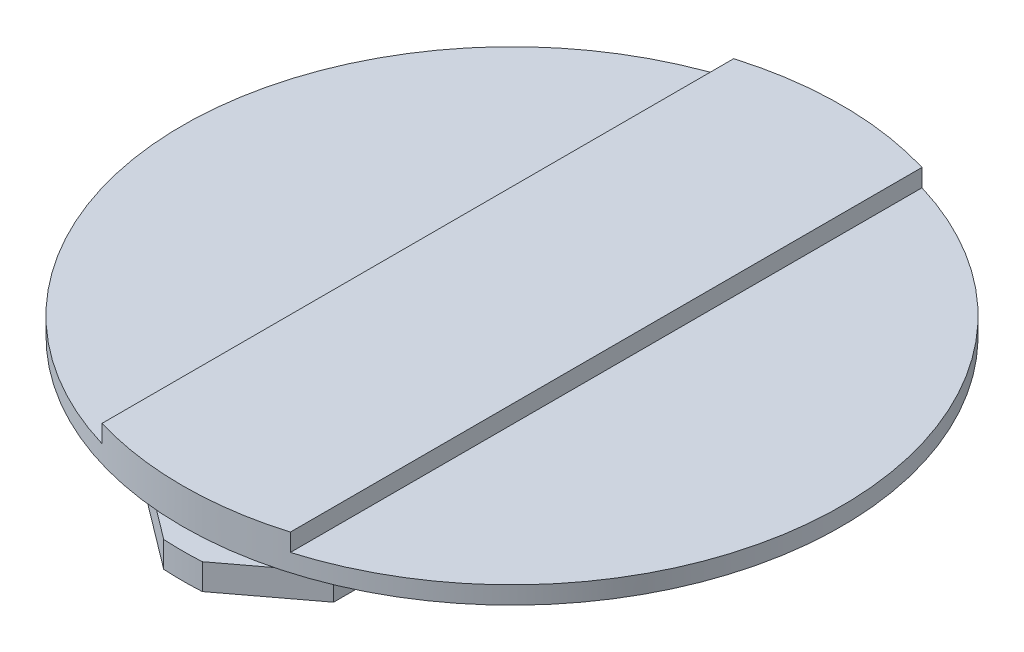
ISO-10303-21;
HEADER;
FILE_DESCRIPTION(('STEP AP214'),'2;1');
FILE_NAME('part.step','',(''),(''),'','','');
FILE_SCHEMA(('AUTOMOTIVE_DESIGN { 1 0 10303 214 1 1 1 1 }'));
ENDSEC;
DATA;
#1=APPLICATION_CONTEXT('core data for automotive mechanical design processes');
#2=APPLICATION_PROTOCOL_DEFINITION('international standard','automotive_design',2000,#1);
#3=PRODUCT_CONTEXT('',#1,'mechanical');
#4=PRODUCT('Part','Part','',(#3));
#5=PRODUCT_RELATED_PRODUCT_CATEGORY('part','',(#4));
#6=PRODUCT_DEFINITION_FORMATION('','',#4);
#7=PRODUCT_DEFINITION_CONTEXT('part definition',#1,'design');
#8=PRODUCT_DEFINITION('design','',#6,#7);
#9=PRODUCT_DEFINITION_SHAPE('','',#8);
#10=(LENGTH_UNIT() NAMED_UNIT(*) SI_UNIT(.MILLI.,.METRE.));
#11=(NAMED_UNIT(*) PLANE_ANGLE_UNIT() SI_UNIT($,.RADIAN.));
#12=(NAMED_UNIT(*) SI_UNIT($,.STERADIAN.) SOLID_ANGLE_UNIT());
#13=UNCERTAINTY_MEASURE_WITH_UNIT(LENGTH_MEASURE(1.E-05),#10,'distance_accuracy_value','');
#14=(GEOMETRIC_REPRESENTATION_CONTEXT(3) GLOBAL_UNCERTAINTY_ASSIGNED_CONTEXT((#13)) GLOBAL_UNIT_ASSIGNED_CONTEXT((#10,
#11,#12)) REPRESENTATION_CONTEXT('',''));
#15=CARTESIAN_POINT('',(0.,0.,0.));
#16=DIRECTION('',(0.,0.,1.));
#17=DIRECTION('',(1.,0.,0.));
#18=AXIS2_PLACEMENT_3D('',#15,#16,#17);
#19=CARTESIAN_POINT('',(24.5,2.2,0.));
#20=DIRECTION('',(0.,-1.,0.));
#21=DIRECTION('',(0.,0.,-1.));
#22=AXIS2_PLACEMENT_3D('',#19,#20,#21);
#23=PLANE('',#22);
#24=CARTESIAN_POINT('',(0.,2.2,0.));
#25=DIRECTION('',(0.,1.,0.));
#26=DIRECTION('',(0.,0.,1.));
#27=AXIS2_PLACEMENT_3D('',#24,#25,#26);
#28=CIRCLE('',#27,24.5);
#29=CARTESIAN_POINT('',(8.,2.2,-23.1570723538188));
#30=VERTEX_POINT('',#29);
#31=CARTESIAN_POINT('',(-8.,2.2,-23.1570723538188));
#32=VERTEX_POINT('',#31);
#33=EDGE_CURVE('E161',#30,#32,#28,.T.);
#34=ORIENTED_EDGE('',*,*,#33,.F.);
#35=DIRECTION('',(-0.79863551004729,0.,-0.601815023152052));
#36=VECTOR('',#35,1.);
#37=CARTESIAN_POINT('',(29.6540115073893,2.2,-6.83960428145292));
#38=LINE('',#37,#36);
#39=CARTESIAN_POINT('',(1.63675647815442,2.2,-27.952120281496));
#40=VERTEX_POINT('',#39);
#41=EDGE_CURVE('E148',#30,#40,#38,.T.);
#42=ORIENTED_EDGE('',*,*,#41,.T.);
#43=CARTESIAN_POINT('',(0.,2.2,0.));
#44=DIRECTION('',(0.,1.,0.));
#45=DIRECTION('',(0.,0.,1.));
#46=AXIS2_PLACEMENT_3D('',#43,#44,#45);
#47=CIRCLE('',#46,28.);
#48=CARTESIAN_POINT('',(-1.6367564781544,2.2,-27.952120281496));
#49=VERTEX_POINT('',#48);
#50=EDGE_CURVE('E147',#40,#49,#47,.T.);
#51=ORIENTED_EDGE('',*,*,#50,.T.);
#52=DIRECTION('',(0.79863551004729,0.,-0.601815023152052));
#53=VECTOR('',#52,1.);
#54=CARTESIAN_POINT('',(1.59910371012693,2.2,-30.3905158319418));
#55=LINE('',#54,#53);
#56=EDGE_CURVE('E205',#32,#49,#55,.T.);
#57=ORIENTED_EDGE('',*,*,#56,.F.);
#58=EDGE_LOOP('',(#34,#42,#51,#57));
#59=FACE_BOUND('',#58,.T.);
#60=ADVANCED_FACE('F33',(#59),#23,.F.);
#61=CARTESIAN_POINT('',(28.,0.,0.));
#62=DIRECTION('',(0.,1.,0.));
#63=DIRECTION('',(0.,0.,1.));
#64=AXIS2_PLACEMENT_3D('',#61,#62,#63);
#65=PLANE('',#64);
#66=CARTESIAN_POINT('',(0.,0.,0.));
#67=DIRECTION('',(0.,1.,0.));
#68=DIRECTION('',(0.,0.,1.));
#69=AXIS2_PLACEMENT_3D('',#66,#67,#68);
#70=CIRCLE('',#69,28.);
#71=CARTESIAN_POINT('',(1.63675647815442,0.,-27.952120281496));
#72=VERTEX_POINT('',#71);
#73=CARTESIAN_POINT('',(-1.6367564781544,0.,-27.952120281496));
#74=VERTEX_POINT('',#73);
#75=EDGE_CURVE('E146',#72,#74,#70,.T.);
#76=ORIENTED_EDGE('',*,*,#75,.F.);
#77=DIRECTION('',(-0.79863551004729,0.,-0.601815023152052));
#78=VECTOR('',#77,1.);
#79=CARTESIAN_POINT('',(-7.81346632591159,0.,-35.0733739498738));
#80=LINE('',#79,#78);
#81=CARTESIAN_POINT('',(8.00000000000001,0.,-23.1570723538188));
#82=VERTEX_POINT('',#81);
#83=EDGE_CURVE('E135',#82,#72,#80,.T.);
#84=ORIENTED_EDGE('',*,*,#83,.F.);
#85=DIRECTION('',(0.,0.,1.));
#86=VECTOR('',#85,1.);
#87=CARTESIAN_POINT('',(8.,0.,-28.));
#88=LINE('',#87,#86);
#89=CARTESIAN_POINT('',(8.,0.,23.1570723538188));
#90=VERTEX_POINT('',#89);
#91=EDGE_CURVE('E56',#82,#90,#88,.T.);
#92=ORIENTED_EDGE('',*,*,#91,.T.);
#93=DIRECTION('',(0.798635510047289,0.,-0.601815023152053));
#94=VECTOR('',#93,1.);
#95=CARTESIAN_POINT('',(35.868374123174,0.,2.15674616352084));
#96=LINE('',#95,#94);
#97=CARTESIAN_POINT('',(1.6367564781544,0.,27.952120281496));
#98=VERTEX_POINT('',#97);
#99=EDGE_CURVE('E455',#98,#90,#96,.T.);
#100=ORIENTED_EDGE('',*,*,#99,.F.);
#101=CARTESIAN_POINT('',(-1.63675647815442,0.,27.952120281496));
#102=VERTEX_POINT('',#101);
#103=EDGE_CURVE('E152',#102,#98,#70,.T.);
#104=ORIENTED_EDGE('',*,*,#103,.F.);
#105=DIRECTION('',(0.798635510047289,0.,0.601815023152053));
#106=VECTOR('',#105,1.);
#107=CARTESIAN_POINT('',(-35.868374123174,0.,2.15674616352091));
#108=LINE('',#107,#106);
#109=CARTESIAN_POINT('',(-8.,0.,23.1570723538188));
#110=VERTEX_POINT('',#109);
#111=EDGE_CURVE('E210',#110,#102,#108,.T.);
#112=ORIENTED_EDGE('',*,*,#111,.F.);
#113=DIRECTION('',(0.,0.,1.));
#114=VECTOR('',#113,1.);
#115=CARTESIAN_POINT('',(-8.,0.,-28.));
#116=LINE('',#115,#114);
#117=CARTESIAN_POINT('',(-8.,0.,-23.1570723538188));
#118=VERTEX_POINT('',#117);
#119=EDGE_CURVE('E448',#118,#110,#116,.T.);
#120=ORIENTED_EDGE('',*,*,#119,.F.);
#121=DIRECTION('',(0.79863551004729,0.,-0.601815023152052));
#122=VECTOR('',#121,1.);
#123=CARTESIAN_POINT('',(7.8134663259116,0.,-35.0733739498738));
#124=LINE('',#123,#122);
#125=EDGE_CURVE('E48',#118,#74,#124,.T.);
#126=ORIENTED_EDGE('',*,*,#125,.T.);
#127=EDGE_LOOP('',(#76,#84,#92,#100,#104,#112,#120,#126));
#128=FACE_BOUND('',#127,.T.);
#129=ADVANCED_FACE('F35',(#128),#65,.F.);
#130=CARTESIAN_POINT('',(0.,16.3116038960441,0.));
#131=DIRECTION('',(0.,1.,0.));
#132=DIRECTION('',(0.,0.,1.));
#133=AXIS2_PLACEMENT_3D('',#130,#131,#132);
#134=CYLINDRICAL_SURFACE('',#133,28.);
#135=ORIENTED_EDGE('',*,*,#50,.F.);
#136=DIRECTION('',(0.,-1.,0.));
#137=VECTOR('',#136,1.);
#138=CARTESIAN_POINT('',(1.63675647815442,10.4176441152345,-27.952120281496));
#139=LINE('',#138,#137);
#140=EDGE_CURVE('E138',#40,#72,#139,.T.);
#141=ORIENTED_EDGE('',*,*,#140,.T.);
#142=ORIENTED_EDGE('',*,*,#75,.T.);
#143=DIRECTION('',(0.,-1.,0.));
#144=VECTOR('',#143,1.);
#145=CARTESIAN_POINT('',(-1.6367564781544,10.4176441152345,-27.952120281496));
#146=LINE('',#145,#144);
#147=EDGE_CURVE('E471',#49,#74,#146,.T.);
#148=ORIENTED_EDGE('',*,*,#147,.F.);
#149=EDGE_LOOP('',(#135,#141,#142,#148));
#150=FACE_BOUND('',#149,.T.);
#151=ADVANCED_FACE('F144',(#150),#134,.T.);
#152=CARTESIAN_POINT('',(-8.,2.45,-28.));
#153=DIRECTION('',(1.,0.,0.));
#154=DIRECTION('',(0.,0.,-1.));
#155=AXIS2_PLACEMENT_3D('',#152,#153,#154);
#156=PLANE('',#155);
#157=DIRECTION('',(0.,1.,0.));
#158=VECTOR('',#157,1.);
#159=CARTESIAN_POINT('',(-8.,2.45,-23.1570723538188));
#160=LINE('',#159,#158);
#161=EDGE_CURVE('E41',#118,#32,#160,.T.);
#162=ORIENTED_EDGE('',*,*,#161,.F.);
#163=ORIENTED_EDGE('',*,*,#119,.T.);
#164=DIRECTION('',(0.,1.,0.));
#165=VECTOR('',#164,1.);
#166=CARTESIAN_POINT('',(-8.,2.45,23.1570723538188));
#167=LINE('',#166,#165);
#168=CARTESIAN_POINT('',(-8.,2.2,23.1570723538188));
#169=VERTEX_POINT('',#168);
#170=EDGE_CURVE('E200',#110,#169,#167,.T.);
#171=ORIENTED_EDGE('',*,*,#170,.T.);
#172=DIRECTION('',(0.,1.,0.));
#173=VECTOR('',#172,1.);
#174=CARTESIAN_POINT('',(-8.,16.3116038960441,23.1570723538188));
#175=LINE('',#174,#173);
#176=CARTESIAN_POINT('',(-8.,2.45,23.1570723538188));
#177=VERTEX_POINT('',#176);
#178=EDGE_CURVE('E220',#177,#169,#175,.F.);
#179=ORIENTED_EDGE('',*,*,#178,.F.);
#180=DIRECTION('',(0.,0.,1.));
#181=VECTOR('',#180,1.);
#182=CARTESIAN_POINT('',(-8.,2.45,-28.));
#183=LINE('',#182,#181);
#184=CARTESIAN_POINT('',(-8.,2.45,-23.1570723538188));
#185=VERTEX_POINT('',#184);
#186=EDGE_CURVE('E217',#185,#177,#183,.T.);
#187=ORIENTED_EDGE('',*,*,#186,.F.);
#188=DIRECTION('',(0.,1.,0.));
#189=VECTOR('',#188,1.);
#190=CARTESIAN_POINT('',(-8.,16.3116038960441,-23.1570723538188));
#191=LINE('',#190,#189);
#192=EDGE_CURVE('E214',#32,#185,#191,.T.);
#193=ORIENTED_EDGE('',*,*,#192,.F.);
#194=EDGE_LOOP('',(#162,#163,#171,#179,#187,#193));
#195=FACE_BOUND('',#194,.T.);
#196=ADVANCED_FACE('F215',(#195),#156,.F.);
#197=CARTESIAN_POINT('',(-1.63675647815442,2.2,27.952120281496));
#198=VERTEX_POINT('',#197);
#199=CARTESIAN_POINT('',(1.6367564781544,2.2,27.952120281496));
#200=VERTEX_POINT('',#199);
#201=EDGE_CURVE('E151',#198,#200,#47,.T.);
#202=ORIENTED_EDGE('',*,*,#201,.F.);
#203=DIRECTION('',(0.,-1.,0.));
#204=VECTOR('',#203,1.);
#205=CARTESIAN_POINT('',(-1.63675647815442,10.4176441152345,27.952120281496));
#206=LINE('',#205,#204);
#207=EDGE_CURVE('E449',#198,#102,#206,.T.);
#208=ORIENTED_EDGE('',*,*,#207,.T.);
#209=ORIENTED_EDGE('',*,*,#103,.T.);
#210=DIRECTION('',(0.,-1.,0.));
#211=VECTOR('',#210,1.);
#212=CARTESIAN_POINT('',(1.6367564781544,10.4176441152345,27.952120281496));
#213=LINE('',#212,#211);
#214=EDGE_CURVE('E457',#200,#98,#213,.T.);
#215=ORIENTED_EDGE('',*,*,#214,.F.);
#216=EDGE_LOOP('',(#202,#208,#209,#215));
#217=FACE_BOUND('',#216,.T.);
#218=ADVANCED_FACE('F283',(#217),#134,.T.);
#219=CARTESIAN_POINT('',(0.,7.,0.));
#220=DIRECTION('',(0.,-1.,0.));
#221=DIRECTION('',(0.,0.,-1.));
#222=AXIS2_PLACEMENT_3D('',#219,#220,#221);
#223=PLANE('',#222);
#224=CARTESIAN_POINT('',(0.,7.,0.));
#225=DIRECTION('',(0.,1.,0.));
#226=DIRECTION('',(0.,0.,1.));
#227=AXIS2_PLACEMENT_3D('',#224,#225,#226);
#228=CIRCLE('',#227,28.);
#229=CARTESIAN_POINT('',(8.,7.,-26.8328157299975));
#230=VERTEX_POINT('',#229);
#231=CARTESIAN_POINT('',(-8.,7.,-26.8328157299975));
#232=VERTEX_POINT('',#231);
#233=EDGE_CURVE('E171',#230,#232,#228,.T.);
#234=ORIENTED_EDGE('',*,*,#233,.T.);
#235=DIRECTION('',(0.,0.,1.));
#236=VECTOR('',#235,1.);
#237=CARTESIAN_POINT('',(-8.,7.,-28.));
#238=LINE('',#237,#236);
#239=CARTESIAN_POINT('',(-8.,7.,26.8328157299975));
#240=VERTEX_POINT('',#239);
#241=EDGE_CURVE('E237',#232,#240,#238,.T.);
#242=ORIENTED_EDGE('',*,*,#241,.T.);
#243=CARTESIAN_POINT('',(8.,7.,26.8328157299975));
#244=VERTEX_POINT('',#243);
#245=EDGE_CURVE('E170',#240,#244,#228,.T.);
#246=ORIENTED_EDGE('',*,*,#245,.T.);
#247=DIRECTION('',(0.,0.,1.));
#248=VECTOR('',#247,1.);
#249=CARTESIAN_POINT('',(8.,7.,-28.));
#250=LINE('',#249,#248);
#251=EDGE_CURVE('E157',#230,#244,#250,.T.);
#252=ORIENTED_EDGE('',*,*,#251,.F.);
#253=EDGE_LOOP('',(#234,#242,#246,#252));
#254=FACE_BOUND('',#253,.T.);
#255=ADVANCED_FACE('F281',(#254),#223,.F.);
#256=CARTESIAN_POINT('',(0.,16.3116038960441,0.));
#257=DIRECTION('',(0.,1.,0.));
#258=DIRECTION('',(0.,0.,1.));
#259=AXIS2_PLACEMENT_3D('',#256,#257,#258);
#260=CYLINDRICAL_SURFACE('',#259,28.);
#261=ORIENTED_EDGE('',*,*,#245,.F.);
#262=DIRECTION('',(0.,1.,0.));
#263=VECTOR('',#262,1.);
#264=CARTESIAN_POINT('',(-8.00000000000001,16.3116038960441,26.8328157299975));
#265=LINE('',#264,#263);
#266=CARTESIAN_POINT('',(-8.,5.5,26.8328157299975));
#267=VERTEX_POINT('',#266);
#268=EDGE_CURVE('E188',#240,#267,#265,.F.);
#269=ORIENTED_EDGE('',*,*,#268,.T.);
#270=CARTESIAN_POINT('',(0.,5.5,0.));
#271=DIRECTION('',(0.,-1.,0.));
#272=DIRECTION('',(1.,0.,0.));
#273=AXIS2_PLACEMENT_3D('',#270,#271,#272);
#274=CIRCLE('',#273,28.);
#275=CARTESIAN_POINT('',(-8.,5.5,-26.8328157299975));
#276=VERTEX_POINT('',#275);
#277=EDGE_CURVE('E182',#267,#276,#274,.T.);
#278=ORIENTED_EDGE('',*,*,#277,.T.);
#279=DIRECTION('',(0.,1.,0.));
#280=VECTOR('',#279,1.);
#281=CARTESIAN_POINT('',(-8.00000000000001,16.3116038960441,-26.8328157299975));
#282=LINE('',#281,#280);
#283=EDGE_CURVE('E185',#276,#232,#282,.T.);
#284=ORIENTED_EDGE('',*,*,#283,.T.);
#285=ORIENTED_EDGE('',*,*,#233,.F.);
#286=DIRECTION('',(0.,1.,0.));
#287=VECTOR('',#286,1.);
#288=CARTESIAN_POINT('',(7.99999999999998,16.3116038960441,-26.8328157299975));
#289=LINE('',#288,#287);
#290=CARTESIAN_POINT('',(7.99999999999998,5.49999999999999,-26.8328157299975));
#291=VERTEX_POINT('',#290);
#292=EDGE_CURVE('E174',#230,#291,#289,.F.);
#293=ORIENTED_EDGE('',*,*,#292,.T.);
#294=CARTESIAN_POINT('',(0.,5.49999999999999,0.));
#295=DIRECTION('',(0.,-1.,0.));
#296=DIRECTION('',(0.,0.,-1.));
#297=AXIS2_PLACEMENT_3D('',#294,#295,#296);
#298=CIRCLE('',#297,28.);
#299=CARTESIAN_POINT('',(8.,5.49999999999999,26.8328157299975));
#300=VERTEX_POINT('',#299);
#301=EDGE_CURVE('E177',#291,#300,#298,.T.);
#302=ORIENTED_EDGE('',*,*,#301,.T.);
#303=DIRECTION('',(0.,1.,0.));
#304=VECTOR('',#303,1.);
#305=CARTESIAN_POINT('',(7.99999999999998,16.3116038960441,26.8328157299975));
#306=LINE('',#305,#304);
#307=EDGE_CURVE('E179',#300,#244,#306,.T.);
#308=ORIENTED_EDGE('',*,*,#307,.T.);
#309=EDGE_LOOP('',(#261,#269,#278,#284,#285,#293,#302,#308));
#310=FACE_BOUND('',#309,.T.);
#311=CARTESIAN_POINT('',(0.,4.,0.));
#312=DIRECTION('',(0.,1.,0.));
#313=DIRECTION('',(0.,0.,1.));
#314=AXIS2_PLACEMENT_3D('',#311,#312,#313);
#315=CIRCLE('',#314,28.);
#316=CARTESIAN_POINT('',(0.,4.,28.));
#317=VERTEX_POINT('',#316);
#318=EDGE_CURVE('E167',#317,#317,#315,.T.);
#319=ORIENTED_EDGE('',*,*,#318,.T.);
#320=EDGE_LOOP('',(#319));
#321=FACE_BOUND('',#320,.T.);
#322=ADVANCED_FACE('F253',(#310,#321),#260,.T.);
#323=CARTESIAN_POINT('',(28.,4.,0.));
#324=DIRECTION('',(0.,1.,0.));
#325=DIRECTION('',(0.,0.,1.));
#326=AXIS2_PLACEMENT_3D('',#323,#324,#325);
#327=PLANE('',#326);
#328=ORIENTED_EDGE('',*,*,#318,.F.);
#329=EDGE_LOOP('',(#328));
#330=FACE_BOUND('',#329,.T.);
#331=CARTESIAN_POINT('',(0.,4.,0.));
#332=DIRECTION('',(0.,1.,0.));
#333=DIRECTION('',(0.,0.,1.));
#334=AXIS2_PLACEMENT_3D('',#331,#332,#333);
#335=CIRCLE('',#334,24.5);
#336=CARTESIAN_POINT('',(0.,4.,24.5));
#337=VERTEX_POINT('',#336);
#338=EDGE_CURVE('E164',#337,#337,#335,.T.);
#339=ORIENTED_EDGE('',*,*,#338,.T.);
#340=EDGE_LOOP('',(#339));
#341=FACE_BOUND('',#340,.T.);
#342=ADVANCED_FACE('F276',(#330,#341),#327,.F.);
#343=CARTESIAN_POINT('',(0.,16.3116038960441,0.));
#344=DIRECTION('',(0.,1.,0.));
#345=DIRECTION('',(0.,0.,1.));
#346=AXIS2_PLACEMENT_3D('',#343,#344,#345);
#347=CYLINDRICAL_SURFACE('',#346,24.5);
#348=ORIENTED_EDGE('',*,*,#33,.T.);
#349=ORIENTED_EDGE('',*,*,#192,.T.);
#350=CARTESIAN_POINT('',(0.,2.45,0.));
#351=DIRECTION('',(0.,1.,0.));
#352=DIRECTION('',(0.,0.,1.));
#353=AXIS2_PLACEMENT_3D('',#350,#351,#352);
#354=CIRCLE('',#353,24.5);
#355=EDGE_CURVE('E194',#185,#177,#354,.T.);
#356=ORIENTED_EDGE('',*,*,#355,.T.);
#357=ORIENTED_EDGE('',*,*,#178,.T.);
#358=CARTESIAN_POINT('',(8.,2.2,23.1570723538188));
#359=VERTEX_POINT('',#358);
#360=EDGE_CURVE('E160',#169,#359,#28,.T.);
#361=ORIENTED_EDGE('',*,*,#360,.T.);
#362=DIRECTION('',(0.,1.,0.));
#363=VECTOR('',#362,1.);
#364=CARTESIAN_POINT('',(7.99999999999998,16.3116038960441,23.1570723538188));
#365=LINE('',#364,#363);
#366=CARTESIAN_POINT('',(8.,2.45,23.1570723538188));
#367=VERTEX_POINT('',#366);
#368=EDGE_CURVE('E230',#359,#367,#365,.T.);
#369=ORIENTED_EDGE('',*,*,#368,.T.);
#370=CARTESIAN_POINT('',(0.,2.45,0.));
#371=DIRECTION('',(0.,1.,0.));
#372=DIRECTION('',(0.,0.,1.));
#373=AXIS2_PLACEMENT_3D('',#370,#371,#372);
#374=CIRCLE('',#373,24.5);
#375=CARTESIAN_POINT('',(8.,2.45,-23.1570723538188));
#376=VERTEX_POINT('',#375);
#377=EDGE_CURVE('E191',#367,#376,#374,.T.);
#378=ORIENTED_EDGE('',*,*,#377,.T.);
#379=DIRECTION('',(0.,1.,0.));
#380=VECTOR('',#379,1.);
#381=CARTESIAN_POINT('',(7.99999999999998,16.3116038960441,-23.1570723538188));
#382=LINE('',#381,#380);
#383=EDGE_CURVE('E225',#376,#30,#382,.F.);
#384=ORIENTED_EDGE('',*,*,#383,.T.);
#385=EDGE_LOOP('',(#348,#349,#356,#357,#361,#369,#378,#384));
#386=FACE_BOUND('',#385,.T.);
#387=ORIENTED_EDGE('',*,*,#338,.F.);
#388=EDGE_LOOP('',(#387));
#389=FACE_BOUND('',#388,.T.);
#390=ADVANCED_FACE('F223',(#386,#389),#347,.T.);
#391=ORIENTED_EDGE('',*,*,#360,.F.);
#392=DIRECTION('',(0.798635510047289,0.,0.601815023152053));
#393=VECTOR('',#392,1.);
#394=CARTESIAN_POINT('',(1.5991037101269,2.2,30.3905158319418));
#395=LINE('',#394,#393);
#396=EDGE_CURVE('E445',#169,#198,#395,.T.);
#397=ORIENTED_EDGE('',*,*,#396,.T.);
#398=ORIENTED_EDGE('',*,*,#201,.T.);
#399=DIRECTION('',(0.798635510047289,0.,-0.601815023152053));
#400=VECTOR('',#399,1.);
#401=CARTESIAN_POINT('',(29.6540115073893,2.2,6.83960428145287));
#402=LINE('',#401,#400);
#403=EDGE_CURVE('E460',#200,#359,#402,.T.);
#404=ORIENTED_EDGE('',*,*,#403,.T.);
#405=EDGE_LOOP('',(#391,#397,#398,#404));
#406=FACE_BOUND('',#405,.T.);
#407=ADVANCED_FACE('F257',(#406),#23,.F.);
#408=CARTESIAN_POINT('',(8.,5.49999999999999,-28.));
#409=DIRECTION('',(0.,-1.,0.));
#410=DIRECTION('',(0.,0.,-1.));
#411=AXIS2_PLACEMENT_3D('',#408,#409,#410);
#412=PLANE('',#411);
#413=DIRECTION('',(0.,0.,1.));
#414=VECTOR('',#413,1.);
#415=CARTESIAN_POINT('',(8.,5.49999999999999,-28.));
#416=LINE('',#415,#414);
#417=EDGE_CURVE('E155',#291,#300,#416,.T.);
#418=ORIENTED_EDGE('',*,*,#417,.T.);
#419=ORIENTED_EDGE('',*,*,#301,.F.);
#420=EDGE_LOOP('',(#418,#419));
#421=FACE_BOUND('',#420,.T.);
#422=ADVANCED_FACE('F255',(#421),#412,.F.);
#423=CARTESIAN_POINT('',(8.,7.,-28.));
#424=DIRECTION('',(-1.,0.,0.));
#425=DIRECTION('',(0.,-1.,0.));
#426=AXIS2_PLACEMENT_3D('',#423,#424,#425);
#427=PLANE('',#426);
#428=ORIENTED_EDGE('',*,*,#417,.F.);
#429=ORIENTED_EDGE('',*,*,#292,.F.);
#430=ORIENTED_EDGE('',*,*,#251,.T.);
#431=ORIENTED_EDGE('',*,*,#307,.F.);
#432=EDGE_LOOP('',(#428,#429,#430,#431));
#433=FACE_BOUND('',#432,.T.);
#434=ADVANCED_FACE('F248',(#433),#427,.F.);
#435=CARTESIAN_POINT('',(-8.,7.,-28.));
#436=DIRECTION('',(1.,0.,0.));
#437=DIRECTION('',(0.,1.,0.));
#438=AXIS2_PLACEMENT_3D('',#435,#436,#437);
#439=PLANE('',#438);
#440=DIRECTION('',(0.,0.,1.));
#441=VECTOR('',#440,1.);
#442=CARTESIAN_POINT('',(-8.,5.49999999999999,-28.));
#443=LINE('',#442,#441);
#444=EDGE_CURVE('E232',#276,#267,#443,.T.);
#445=ORIENTED_EDGE('',*,*,#444,.T.);
#446=ORIENTED_EDGE('',*,*,#268,.F.);
#447=ORIENTED_EDGE('',*,*,#241,.F.);
#448=ORIENTED_EDGE('',*,*,#283,.F.);
#449=EDGE_LOOP('',(#445,#446,#447,#448));
#450=FACE_BOUND('',#449,.T.);
#451=ADVANCED_FACE('F263',(#450),#439,.F.);
#452=CARTESIAN_POINT('',(-8.,5.49999999999999,-28.));
#453=DIRECTION('',(0.,-1.,0.));
#454=DIRECTION('',(1.,0.,0.));
#455=AXIS2_PLACEMENT_3D('',#452,#453,#454);
#456=PLANE('',#455);
#457=ORIENTED_EDGE('',*,*,#444,.F.);
#458=ORIENTED_EDGE('',*,*,#277,.F.);
#459=EDGE_LOOP('',(#457,#458));
#460=FACE_BOUND('',#459,.T.);
#461=ADVANCED_FACE('F291',(#460),#456,.F.);
#462=CARTESIAN_POINT('',(8.,2.45,-28.));
#463=DIRECTION('',(0.,1.,0.));
#464=DIRECTION('',(0.,0.,1.));
#465=AXIS2_PLACEMENT_3D('',#462,#463,#464);
#466=PLANE('',#465);
#467=DIRECTION('',(0.,0.,1.));
#468=VECTOR('',#467,1.);
#469=CARTESIAN_POINT('',(8.,2.45,-28.));
#470=LINE('',#469,#468);
#471=EDGE_CURVE('E219',#376,#367,#470,.T.);
#472=ORIENTED_EDGE('',*,*,#471,.F.);
#473=ORIENTED_EDGE('',*,*,#377,.F.);
#474=EDGE_LOOP('',(#472,#473));
#475=FACE_BOUND('',#474,.T.);
#476=ADVANCED_FACE('F293',(#475),#466,.F.);
#477=CARTESIAN_POINT('',(8.,0.,-28.));
#478=DIRECTION('',(-1.,0.,0.));
#479=DIRECTION('',(0.,-1.,0.));
#480=AXIS2_PLACEMENT_3D('',#477,#478,#479);
#481=PLANE('',#480);
#482=ORIENTED_EDGE('',*,*,#91,.F.);
#483=DIRECTION('',(0.,1.,0.));
#484=VECTOR('',#483,1.);
#485=CARTESIAN_POINT('',(8.,0.,-23.1570723538188));
#486=LINE('',#485,#484);
#487=EDGE_CURVE('E11',#82,#30,#486,.T.);
#488=ORIENTED_EDGE('',*,*,#487,.T.);
#489=ORIENTED_EDGE('',*,*,#383,.F.);
#490=ORIENTED_EDGE('',*,*,#471,.T.);
#491=ORIENTED_EDGE('',*,*,#368,.F.);
#492=DIRECTION('',(0.,-1.,0.));
#493=VECTOR('',#492,1.);
#494=CARTESIAN_POINT('',(8.,0.,23.1570723538188));
#495=LINE('',#494,#493);
#496=EDGE_CURVE('E197',#359,#90,#495,.T.);
#497=ORIENTED_EDGE('',*,*,#496,.T.);
#498=EDGE_LOOP('',(#482,#488,#489,#490,#491,#497));
#499=FACE_BOUND('',#498,.T.);
#500=ADVANCED_FACE('F298',(#499),#481,.F.);
#501=CARTESIAN_POINT('',(-28.,2.45,-28.));
#502=DIRECTION('',(0.,1.,0.));
#503=DIRECTION('',(0.,0.,1.));
#504=AXIS2_PLACEMENT_3D('',#501,#502,#503);
#505=PLANE('',#504);
#506=ORIENTED_EDGE('',*,*,#186,.T.);
#507=ORIENTED_EDGE('',*,*,#355,.F.);
#508=EDGE_LOOP('',(#506,#507));
#509=FACE_BOUND('',#508,.T.);
#510=ADVANCED_FACE('F305',(#509),#505,.F.);
#511=CARTESIAN_POINT('',(35.868374123174,10.4176441152345,2.15674616352084));
#512=DIRECTION('',(-0.601815023152053,0.,-0.798635510047289));
#513=DIRECTION('',(-0.798635510047289,0.,0.601815023152053));
#514=AXIS2_PLACEMENT_3D('',#511,#512,#513);
#515=PLANE('',#514);
#516=ORIENTED_EDGE('',*,*,#214,.T.);
#517=ORIENTED_EDGE('',*,*,#99,.T.);
#518=ORIENTED_EDGE('',*,*,#496,.F.);
#519=ORIENTED_EDGE('',*,*,#403,.F.);
#520=EDGE_LOOP('',(#516,#517,#518,#519));
#521=FACE_BOUND('',#520,.T.);
#522=ADVANCED_FACE('F310',(#521),#515,.F.);
#523=CARTESIAN_POINT('',(-35.868374123174,10.4176441152345,2.15674616352091));
#524=DIRECTION('',(0.601815023152053,0.,-0.798635510047289));
#525=DIRECTION('',(-0.798635510047289,0.,-0.601815023152053));
#526=AXIS2_PLACEMENT_3D('',#523,#524,#525);
#527=PLANE('',#526);
#528=ORIENTED_EDGE('',*,*,#170,.F.);
#529=ORIENTED_EDGE('',*,*,#111,.T.);
#530=ORIENTED_EDGE('',*,*,#207,.F.);
#531=ORIENTED_EDGE('',*,*,#396,.F.);
#532=EDGE_LOOP('',(#528,#529,#530,#531));
#533=FACE_BOUND('',#532,.T.);
#534=ADVANCED_FACE('F314',(#533),#527,.F.);
#535=CARTESIAN_POINT('',(7.8134663259116,10.4176441152345,-35.0733739498738));
#536=DIRECTION('',(-0.601815023152052,0.,-0.79863551004729));
#537=DIRECTION('',(-0.79863551004729,0.,0.601815023152052));
#538=AXIS2_PLACEMENT_3D('',#535,#536,#537);
#539=PLANE('',#538);
#540=ORIENTED_EDGE('',*,*,#56,.T.);
#541=ORIENTED_EDGE('',*,*,#147,.T.);
#542=ORIENTED_EDGE('',*,*,#125,.F.);
#543=ORIENTED_EDGE('',*,*,#161,.T.);
#544=EDGE_LOOP('',(#540,#541,#542,#543));
#545=FACE_BOUND('',#544,.T.);
#546=ADVANCED_FACE('F204',(#545),#539,.T.);
#547=CARTESIAN_POINT('',(-7.81346632591159,10.4176441152345,-35.0733739498738));
#548=DIRECTION('',(-0.601815023152052,0.,0.79863551004729));
#549=DIRECTION('',(0.79863551004729,0.,0.601815023152052));
#550=AXIS2_PLACEMENT_3D('',#547,#548,#549);
#551=PLANE('',#550);
#552=ORIENTED_EDGE('',*,*,#487,.F.);
#553=ORIENTED_EDGE('',*,*,#83,.T.);
#554=ORIENTED_EDGE('',*,*,#140,.F.);
#555=ORIENTED_EDGE('',*,*,#41,.F.);
#556=EDGE_LOOP('',(#552,#553,#554,#555));
#557=FACE_BOUND('',#556,.T.);
#558=ADVANCED_FACE('F137',(#557),#551,.F.);
#559=CLOSED_SHELL('',(#60,#129,#151,#196,#218,#255,#322,#342,#390,#407,#422,#434,#451,#461,#476,
#500,#510,#522,#534,#546,#558));
#560=MANIFOLD_SOLID_BREP('B2',#559);
#561=ADVANCED_BREP_SHAPE_REPRESENTATION('',(#18,#560),#14);
#562=SHAPE_DEFINITION_REPRESENTATION(#9,#561);
ENDSEC;
END-ISO-10303-21;
